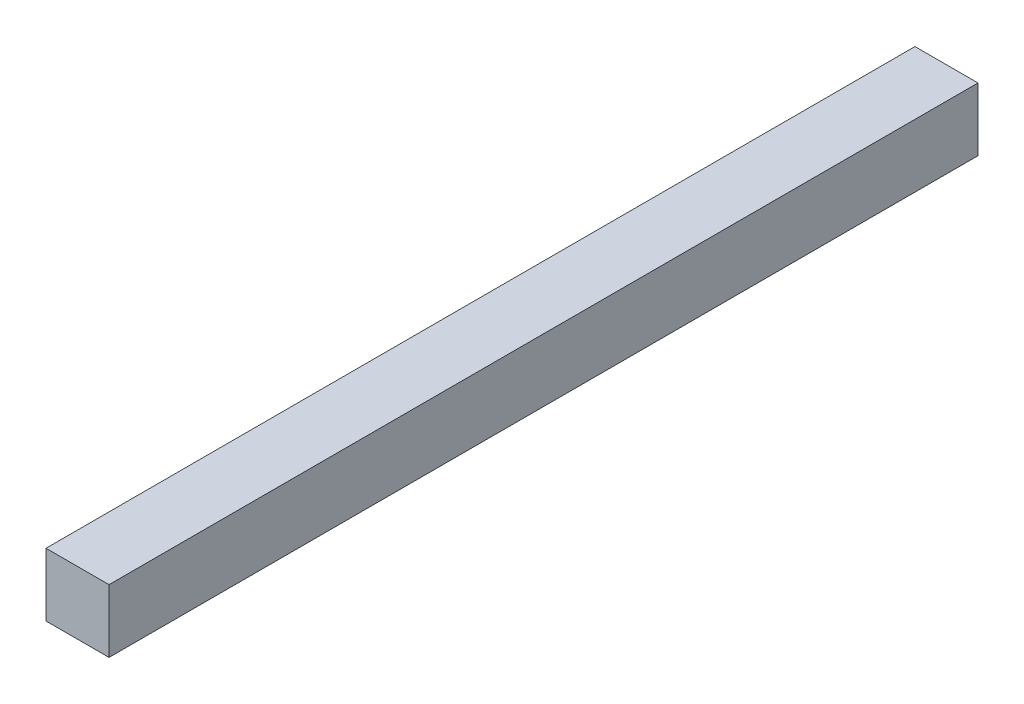
ISO-10303-21;
HEADER;
FILE_DESCRIPTION(('STEP AP214'),'2;1');
FILE_NAME('part.step','',(''),(''),'','','');
FILE_SCHEMA(('AUTOMOTIVE_DESIGN { 1 0 10303 214 1 1 1 1 }'));
ENDSEC;
DATA;
#1=APPLICATION_CONTEXT('core data for automotive mechanical design processes');
#2=APPLICATION_PROTOCOL_DEFINITION('international standard','automotive_design',2000,#1);
#3=PRODUCT_CONTEXT('',#1,'mechanical');
#4=PRODUCT('Part','Part','',(#3));
#5=PRODUCT_RELATED_PRODUCT_CATEGORY('part','',(#4));
#6=PRODUCT_DEFINITION_FORMATION('','',#4);
#7=PRODUCT_DEFINITION_CONTEXT('part definition',#1,'design');
#8=PRODUCT_DEFINITION('design','',#6,#7);
#9=PRODUCT_DEFINITION_SHAPE('','',#8);
#10=(LENGTH_UNIT() NAMED_UNIT(*) SI_UNIT(.MILLI.,.METRE.));
#11=(NAMED_UNIT(*) PLANE_ANGLE_UNIT() SI_UNIT($,.RADIAN.));
#12=(NAMED_UNIT(*) SI_UNIT($,.STERADIAN.) SOLID_ANGLE_UNIT());
#13=UNCERTAINTY_MEASURE_WITH_UNIT(LENGTH_MEASURE(1.E-05),#10,'distance_accuracy_value','');
#14=(GEOMETRIC_REPRESENTATION_CONTEXT(3) GLOBAL_UNCERTAINTY_ASSIGNED_CONTEXT((#13)) GLOBAL_UNIT_ASSIGNED_CONTEXT((#10,
#11,#12)) REPRESENTATION_CONTEXT('',''));
#15=CARTESIAN_POINT('',(0.,0.,0.));
#16=DIRECTION('',(0.,0.,1.));
#17=DIRECTION('',(1.,0.,0.));
#18=AXIS2_PLACEMENT_3D('',#15,#16,#17);
#19=CARTESIAN_POINT('',(0.1994916,0.1994916,0.));
#20=DIRECTION('',(1.,0.,0.));
#21=DIRECTION('',(0.,-1.,0.));
#22=AXIS2_PLACEMENT_3D('',#19,#20,#21);
#23=PLANE('',#22);
#24=DIRECTION('',(0.,0.,1.));
#25=VECTOR('',#24,1.);
#26=CARTESIAN_POINT('',(0.1994916,0.1994916,0.));
#27=LINE('',#26,#25);
#28=CARTESIAN_POINT('',(0.1994916,0.1994916,0.));
#29=VERTEX_POINT('',#28);
#30=CARTESIAN_POINT('',(0.1994916,0.1994916,5.49999916));
#31=VERTEX_POINT('',#30);
#32=EDGE_CURVE('E11',#29,#31,#27,.T.);
#33=ORIENTED_EDGE('',*,*,#32,.T.);
#34=DIRECTION('',(0.,-1.,0.));
#35=VECTOR('',#34,1.);
#36=CARTESIAN_POINT('',(0.1994916,0.1994916,5.49999916));
#37=LINE('',#36,#35);
#38=CARTESIAN_POINT('',(0.1994916,-0.1994916,5.49999916));
#39=VERTEX_POINT('',#38);
#40=EDGE_CURVE('E23',#31,#39,#37,.T.);
#41=ORIENTED_EDGE('',*,*,#40,.T.);
#42=DIRECTION('',(0.,0.,1.));
#43=VECTOR('',#42,1.);
#44=CARTESIAN_POINT('',(0.1994916,-0.1994916,0.));
#45=LINE('',#44,#43);
#46=CARTESIAN_POINT('',(0.1994916,-0.1994916,0.));
#47=VERTEX_POINT('',#46);
#48=EDGE_CURVE('E84',#47,#39,#45,.T.);
#49=ORIENTED_EDGE('',*,*,#48,.F.);
#50=DIRECTION('',(0.,-1.,0.));
#51=VECTOR('',#50,1.);
#52=CARTESIAN_POINT('',(0.1994916,0.1994916,0.));
#53=LINE('',#52,#51);
#54=EDGE_CURVE('E82',#29,#47,#53,.T.);
#55=ORIENTED_EDGE('',*,*,#54,.F.);
#56=EDGE_LOOP('',(#33,#41,#49,#55));
#57=FACE_BOUND('',#56,.T.);
#58=ADVANCED_FACE('F16',(#57),#23,.T.);
#59=CARTESIAN_POINT('',(0.1994916,-0.1994916,0.));
#60=DIRECTION('',(0.,-1.,0.));
#61=DIRECTION('',(-1.,0.,0.));
#62=AXIS2_PLACEMENT_3D('',#59,#60,#61);
#63=PLANE('',#62);
#64=ORIENTED_EDGE('',*,*,#48,.T.);
#65=DIRECTION('',(-1.,0.,0.));
#66=VECTOR('',#65,1.);
#67=CARTESIAN_POINT('',(0.1994916,-0.1994916,5.49999916));
#68=LINE('',#67,#66);
#69=CARTESIAN_POINT('',(-0.1994916,-0.1994916,5.49999916));
#70=VERTEX_POINT('',#69);
#71=EDGE_CURVE('E80',#39,#70,#68,.T.);
#72=ORIENTED_EDGE('',*,*,#71,.T.);
#73=DIRECTION('',(0.,0.,1.));
#74=VECTOR('',#73,1.);
#75=CARTESIAN_POINT('',(-0.1994916,-0.1994916,0.));
#76=LINE('',#75,#74);
#77=CARTESIAN_POINT('',(-0.1994916,-0.1994916,0.));
#78=VERTEX_POINT('',#77);
#79=EDGE_CURVE('E78',#78,#70,#76,.T.);
#80=ORIENTED_EDGE('',*,*,#79,.F.);
#81=DIRECTION('',(-1.,0.,0.));
#82=VECTOR('',#81,1.);
#83=CARTESIAN_POINT('',(0.1994916,-0.1994916,0.));
#84=LINE('',#83,#82);
#85=EDGE_CURVE('E69',#47,#78,#84,.T.);
#86=ORIENTED_EDGE('',*,*,#85,.F.);
#87=EDGE_LOOP('',(#64,#72,#80,#86));
#88=FACE_BOUND('',#87,.T.);
#89=ADVANCED_FACE('F89',(#88),#63,.T.);
#90=CARTESIAN_POINT('',(-0.1994916,-0.1994916,0.));
#91=DIRECTION('',(-0.999999999979736,6.36618282911532E-06,0.));
#92=DIRECTION('',(6.36618282911532E-06,0.999999999979736,0.));
#93=AXIS2_PLACEMENT_3D('',#90,#91,#92);
#94=PLANE('',#93);
#95=ORIENTED_EDGE('',*,*,#79,.T.);
#96=DIRECTION('',(6.36618282911532E-06,0.999999999979736,0.));
#97=VECTOR('',#96,1.);
#98=CARTESIAN_POINT('',(-0.1994916,-0.1994916,5.49999916));
#99=LINE('',#98,#97);
#100=CARTESIAN_POINT('',(-0.19948906,0.1994916,5.49999916));
#101=VERTEX_POINT('',#100);
#102=EDGE_CURVE('E59',#70,#101,#99,.T.);
#103=ORIENTED_EDGE('',*,*,#102,.T.);
#104=DIRECTION('',(0.,0.,1.));
#105=VECTOR('',#104,1.);
#106=CARTESIAN_POINT('',(-0.19948906,0.1994916,0.));
#107=LINE('',#106,#105);
#108=CARTESIAN_POINT('',(-0.19948906,0.1994916,0.));
#109=VERTEX_POINT('',#108);
#110=EDGE_CURVE('E53',#109,#101,#107,.T.);
#111=ORIENTED_EDGE('',*,*,#110,.F.);
#112=DIRECTION('',(6.36618282911532E-06,0.999999999979736,0.));
#113=VECTOR('',#112,1.);
#114=CARTESIAN_POINT('',(-0.1994916,-0.1994916,0.));
#115=LINE('',#114,#113);
#116=EDGE_CURVE('E57',#78,#109,#115,.T.);
#117=ORIENTED_EDGE('',*,*,#116,.F.);
#118=EDGE_LOOP('',(#95,#103,#111,#117));
#119=FACE_BOUND('',#118,.T.);
#120=ADVANCED_FACE('F56',(#119),#94,.T.);
#121=CARTESIAN_POINT('',(-0.19948906,0.1994916,0.));
#122=DIRECTION('',(0.,1.,0.));
#123=DIRECTION('',(1.,0.,0.));
#124=AXIS2_PLACEMENT_3D('',#121,#122,#123);
#125=PLANE('',#124);
#126=ORIENTED_EDGE('',*,*,#110,.T.);
#127=DIRECTION('',(1.,0.,0.));
#128=VECTOR('',#127,1.);
#129=CARTESIAN_POINT('',(-0.19948906,0.1994916,5.49999916));
#130=LINE('',#129,#128);
#131=EDGE_CURVE('E70',#101,#31,#130,.T.);
#132=ORIENTED_EDGE('',*,*,#131,.T.);
#133=ORIENTED_EDGE('',*,*,#32,.F.);
#134=DIRECTION('',(1.,0.,0.));
#135=VECTOR('',#134,1.);
#136=CARTESIAN_POINT('',(-0.19948906,0.1994916,0.));
#137=LINE('',#136,#135);
#138=EDGE_CURVE('E67',#109,#29,#137,.T.);
#139=ORIENTED_EDGE('',*,*,#138,.F.);
#140=EDGE_LOOP('',(#126,#132,#133,#139));
#141=FACE_BOUND('',#140,.T.);
#142=ADVANCED_FACE('F72',(#141),#125,.T.);
#143=CARTESIAN_POINT('',(0.1994916,0.1994916,0.));
#144=DIRECTION('',(0.,0.,1.));
#145=DIRECTION('',(1.,0.,0.));
#146=AXIS2_PLACEMENT_3D('',#143,#144,#145);
#147=PLANE('',#146);
#148=ORIENTED_EDGE('',*,*,#54,.T.);
#149=ORIENTED_EDGE('',*,*,#85,.T.);
#150=ORIENTED_EDGE('',*,*,#116,.T.);
#151=ORIENTED_EDGE('',*,*,#138,.T.);
#152=EDGE_LOOP('',(#148,#149,#150,#151));
#153=FACE_BOUND('',#152,.T.);
#154=ADVANCED_FACE('F66',(#153),#147,.F.);
#155=CARTESIAN_POINT('',(0.1994916,0.1994916,5.49999916));
#156=DIRECTION('',(0.,0.,1.));
#157=DIRECTION('',(1.,0.,0.));
#158=AXIS2_PLACEMENT_3D('',#155,#156,#157);
#159=PLANE('',#158);
#160=ORIENTED_EDGE('',*,*,#131,.F.);
#161=ORIENTED_EDGE('',*,*,#102,.F.);
#162=ORIENTED_EDGE('',*,*,#71,.F.);
#163=ORIENTED_EDGE('',*,*,#40,.F.);
#164=EDGE_LOOP('',(#160,#161,#162,#163));
#165=FACE_BOUND('',#164,.T.);
#166=ADVANCED_FACE('F90',(#165),#159,.T.);
#167=CLOSED_SHELL('',(#58,#89,#120,#142,#154,#166));
#168=MANIFOLD_SOLID_BREP('B1',#167);
#169=ADVANCED_BREP_SHAPE_REPRESENTATION('',(#18,#168),#14);
#170=SHAPE_DEFINITION_REPRESENTATION(#9,#169);
ENDSEC;
END-ISO-10303-21;
